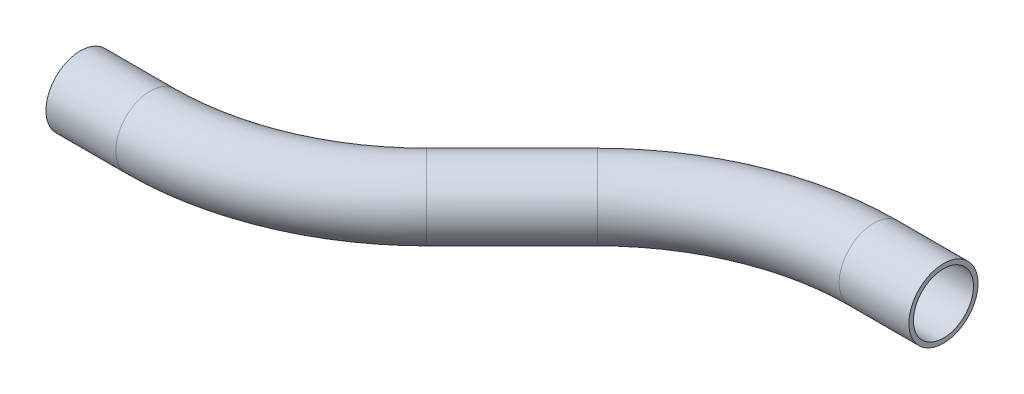
ISO-10303-21;
HEADER;
FILE_DESCRIPTION(('STEP AP214'),'2;1');
FILE_NAME('part.step','',(''),(''),'','','');
FILE_SCHEMA(('AUTOMOTIVE_DESIGN { 1 0 10303 214 1 1 1 1 }'));
ENDSEC;
DATA;
#1=APPLICATION_CONTEXT('core data for automotive mechanical design processes');
#2=APPLICATION_PROTOCOL_DEFINITION('international standard','automotive_design',2000,#1);
#3=PRODUCT_CONTEXT('',#1,'mechanical');
#4=PRODUCT('Part','Part','',(#3));
#5=PRODUCT_RELATED_PRODUCT_CATEGORY('part','',(#4));
#6=PRODUCT_DEFINITION_FORMATION('','',#4);
#7=PRODUCT_DEFINITION_CONTEXT('part definition',#1,'design');
#8=PRODUCT_DEFINITION('design','',#6,#7);
#9=PRODUCT_DEFINITION_SHAPE('','',#8);
#10=(LENGTH_UNIT() NAMED_UNIT(*) SI_UNIT(.MILLI.,.METRE.));
#11=(NAMED_UNIT(*) PLANE_ANGLE_UNIT() SI_UNIT($,.RADIAN.));
#12=(NAMED_UNIT(*) SI_UNIT($,.STERADIAN.) SOLID_ANGLE_UNIT());
#13=UNCERTAINTY_MEASURE_WITH_UNIT(LENGTH_MEASURE(1.E-05),#10,'distance_accuracy_value','');
#14=(GEOMETRIC_REPRESENTATION_CONTEXT(3) GLOBAL_UNCERTAINTY_ASSIGNED_CONTEXT((#13)) GLOBAL_UNIT_ASSIGNED_CONTEXT((#10,
#11,#12)) REPRESENTATION_CONTEXT('',''));
#15=CARTESIAN_POINT('',(0.,0.,0.));
#16=DIRECTION('',(0.,0.,1.));
#17=DIRECTION('',(1.,0.,0.));
#18=AXIS2_PLACEMENT_3D('',#15,#16,#17);
#19=CARTESIAN_POINT('',(0.,0.,0.));
#20=DIRECTION('',(1.,0.,0.));
#21=DIRECTION('',(0.,0.,-1.));
#22=AXIS2_PLACEMENT_3D('',#19,#20,#21);
#23=CYLINDRICAL_SURFACE('',#22,9.525);
#24=CARTESIAN_POINT('',(19.2369265471701,0.,0.));
#25=DIRECTION('',(1.,0.,0.));
#26=DIRECTION('',(0.,0.,-1.));
#27=AXIS2_PLACEMENT_3D('',#24,#25,#26);
#28=CIRCLE('',#27,9.525);
#29=CARTESIAN_POINT('',(19.2369265471701,0.,9.52499999999998));
#30=VERTEX_POINT('',#29);
#31=EDGE_CURVE('E59',#30,#30,#28,.T.);
#32=ORIENTED_EDGE('',*,*,#31,.F.);
#33=EDGE_LOOP('',(#32));
#34=FACE_BOUND('',#33,.T.);
#35=CARTESIAN_POINT('',(0.,0.,0.));
#36=DIRECTION('',(1.,0.,0.));
#37=DIRECTION('',(0.,0.,-1.));
#38=AXIS2_PLACEMENT_3D('',#35,#36,#37);
#39=CIRCLE('',#38,9.525);
#40=CARTESIAN_POINT('',(0.,0.,-9.525));
#41=VERTEX_POINT('',#40);
#42=EDGE_CURVE('E56',#41,#41,#39,.T.);
#43=ORIENTED_EDGE('',*,*,#42,.T.);
#44=EDGE_LOOP('',(#43));
#45=FACE_BOUND('',#44,.T.);
#46=ADVANCED_FACE('F35',(#34,#45),#23,.T.);
#47=CARTESIAN_POINT('',(19.2369265471701,0.,-76.2));
#48=DIRECTION('',(0.,1.,0.));
#49=DIRECTION('',(0.,0.,1.));
#50=AXIS2_PLACEMENT_3D('',#47,#48,#49);
#51=TOROIDAL_SURFACE('',#50,76.2,9.525);
#52=CARTESIAN_POINT('',(73.1184632735851,0.,-22.3184632735852));
#53=DIRECTION('',(0.707106781186546,0.,-0.707106781186549));
#54=DIRECTION('',(-0.707106781186549,0.,-0.707106781186546));
#55=AXIS2_PLACEMENT_3D('',#52,#53,#54);
#56=CIRCLE('',#55,9.525);
#57=CARTESIAN_POINT('',(79.853655364387,0.,-15.5832711827833));
#58=VERTEX_POINT('',#57);
#59=EDGE_CURVE('E62',#58,#58,#56,.T.);
#60=CARTESIAN_POINT('',(19.2369265471701,0.,-76.2));
#61=DIRECTION('',(0.,1.,0.));
#62=DIRECTION('',(0.,0.,1.));
#63=AXIS2_PLACEMENT_3D('',#60,#61,#62);
#64=CIRCLE('',#63,85.725);
#65=EDGE_CURVE('',#30,#58,#64,.T.);
#66=ORIENTED_EDGE('',*,*,#31,.T.);
#67=ORIENTED_EDGE('',*,*,#59,.F.);
#68=ORIENTED_EDGE('',*,*,#65,.T.);
#69=ORIENTED_EDGE('',*,*,#65,.F.);
#70=EDGE_LOOP('',(#66,#68,#67,#69));
#71=FACE_BOUND('',#70,.T.);
#72=ADVANCED_FACE('F81',(#71),#51,.T.);
#73=CARTESIAN_POINT('',(73.1184632735851,0.,-22.3184632735852));
#74=DIRECTION('',(0.707106781186547,0.,-0.707106781186548));
#75=DIRECTION('',(-0.707106781186548,0.,-0.707106781186547));
#76=AXIS2_PLACEMENT_3D('',#73,#74,#75);
#77=CYLINDRICAL_SURFACE('',#76,9.525);
#78=CARTESIAN_POINT('',(96.6376781380146,0.,-45.8376781380148));
#79=DIRECTION('',(0.707106781186547,0.,-0.707106781186548));
#80=DIRECTION('',(-0.707106781186548,0.,-0.707106781186547));
#81=AXIS2_PLACEMENT_3D('',#78,#79,#80);
#82=CIRCLE('',#81,9.525);
#83=CARTESIAN_POINT('',(89.9024860472127,0.,-52.5728702288167));
#84=VERTEX_POINT('',#83);
#85=EDGE_CURVE('E64',#84,#84,#82,.T.);
#86=ORIENTED_EDGE('',*,*,#85,.F.);
#87=EDGE_LOOP('',(#86));
#88=FACE_BOUND('',#87,.T.);
#89=ORIENTED_EDGE('',*,*,#59,.T.);
#90=EDGE_LOOP('',(#89));
#91=FACE_BOUND('',#90,.T.);
#92=ADVANCED_FACE('F74',(#88,#91),#77,.T.);
#93=CARTESIAN_POINT('',(150.51921486443,0.,8.04385858840001));
#94=DIRECTION('',(0.,-1.,0.));
#95=DIRECTION('',(0.,0.,-1.));
#96=AXIS2_PLACEMENT_3D('',#93,#94,#95);
#97=TOROIDAL_SURFACE('',#96,76.2,9.525);
#98=CARTESIAN_POINT('',(150.51921486443,0.,-68.1561414116));
#99=DIRECTION('',(1.,0.,0.));
#100=DIRECTION('',(0.,0.,-1.));
#101=AXIS2_PLACEMENT_3D('',#98,#99,#100);
#102=CIRCLE('',#101,9.525);
#103=CARTESIAN_POINT('',(150.51921486443,0.,-77.6811414116));
#104=VERTEX_POINT('',#103);
#105=EDGE_CURVE('E39',#104,#104,#102,.T.);
#106=CARTESIAN_POINT('',(150.51921486443,0.,8.04385858840001));
#107=DIRECTION('',(0.,-1.,0.));
#108=DIRECTION('',(0.,0.,-1.));
#109=AXIS2_PLACEMENT_3D('',#106,#107,#108);
#110=CIRCLE('',#109,85.725);
#111=EDGE_CURVE('',#84,#104,#110,.T.);
#112=ORIENTED_EDGE('',*,*,#85,.T.);
#113=ORIENTED_EDGE('',*,*,#105,.F.);
#114=ORIENTED_EDGE('',*,*,#111,.T.);
#115=ORIENTED_EDGE('',*,*,#111,.F.);
#116=EDGE_LOOP('',(#112,#114,#113,#115));
#117=FACE_BOUND('',#116,.T.);
#118=ADVANCED_FACE('F72',(#117),#97,.T.);
#119=CARTESIAN_POINT('',(150.51921486443,0.,-68.1561414116));
#120=DIRECTION('',(1.,0.,0.));
#121=DIRECTION('',(0.,0.,-1.));
#122=AXIS2_PLACEMENT_3D('',#119,#120,#121);
#123=CYLINDRICAL_SURFACE('',#122,9.525);
#124=CARTESIAN_POINT('',(169.7561414116,0.,-68.1561414116));
#125=DIRECTION('',(1.,0.,0.));
#126=DIRECTION('',(0.,0.,-1.));
#127=AXIS2_PLACEMENT_3D('',#124,#125,#126);
#128=CIRCLE('',#127,9.525);
#129=CARTESIAN_POINT('',(169.7561414116,0.,-77.6811414116));
#130=VERTEX_POINT('',#129);
#131=EDGE_CURVE('E52',#130,#130,#128,.T.);
#132=ORIENTED_EDGE('',*,*,#131,.F.);
#133=EDGE_LOOP('',(#132));
#134=FACE_BOUND('',#133,.T.);
#135=ORIENTED_EDGE('',*,*,#105,.T.);
#136=EDGE_LOOP('',(#135));
#137=FACE_BOUND('',#136,.T.);
#138=ADVANCED_FACE('F37',(#134,#137),#123,.T.);
#139=CARTESIAN_POINT('',(0.,0.,0.));
#140=DIRECTION('',(1.,0.,0.));
#141=DIRECTION('',(0.,0.,-1.));
#142=AXIS2_PLACEMENT_3D('',#139,#140,#141);
#143=PLANE('',#142);
#144=CARTESIAN_POINT('',(0.,0.,0.));
#145=DIRECTION('',(1.,0.,0.));
#146=DIRECTION('',(0.,0.,-1.));
#147=AXIS2_PLACEMENT_3D('',#144,#145,#146);
#148=CIRCLE('',#147,8.2804);
#149=CARTESIAN_POINT('',(0.,0.,-8.2804));
#150=VERTEX_POINT('',#149);
#151=EDGE_CURVE('E55',#150,#150,#148,.F.);
#152=ORIENTED_EDGE('',*,*,#151,.F.);
#153=EDGE_LOOP('',(#152));
#154=FACE_BOUND('',#153,.T.);
#155=ORIENTED_EDGE('',*,*,#42,.F.);
#156=EDGE_LOOP('',(#155));
#157=FACE_BOUND('',#156,.T.);
#158=ADVANCED_FACE('F79',(#154,#157),#143,.F.);
#159=CARTESIAN_POINT('',(169.7561414116,0.,-68.1561414116));
#160=DIRECTION('',(1.,0.,0.));
#161=DIRECTION('',(0.,0.,-1.));
#162=AXIS2_PLACEMENT_3D('',#159,#160,#161);
#163=PLANE('',#162);
#164=CARTESIAN_POINT('',(169.7561414116,0.,-68.1561414116));
#165=DIRECTION('',(1.,0.,0.));
#166=DIRECTION('',(0.,0.,-1.));
#167=AXIS2_PLACEMENT_3D('',#164,#165,#166);
#168=CIRCLE('',#167,8.2804);
#169=CARTESIAN_POINT('',(169.7561414116,0.,-76.4365414116));
#170=VERTEX_POINT('',#169);
#171=EDGE_CURVE('E10',#170,#170,#168,.F.);
#172=ORIENTED_EDGE('',*,*,#171,.T.);
#173=EDGE_LOOP('',(#172));
#174=FACE_BOUND('',#173,.T.);
#175=ORIENTED_EDGE('',*,*,#131,.T.);
#176=EDGE_LOOP('',(#175));
#177=FACE_BOUND('',#176,.T.);
#178=ADVANCED_FACE('F98',(#174,#177),#163,.T.);
#179=CARTESIAN_POINT('',(0.,0.,0.));
#180=DIRECTION('',(1.,0.,0.));
#181=DIRECTION('',(0.,0.,-1.));
#182=AXIS2_PLACEMENT_3D('',#179,#180,#181);
#183=CYLINDRICAL_SURFACE('',#182,8.2804);
#184=CARTESIAN_POINT('',(19.2369265471701,0.,0.));
#185=DIRECTION('',(1.,0.,0.));
#186=DIRECTION('',(0.,0.,-1.));
#187=AXIS2_PLACEMENT_3D('',#184,#185,#186);
#188=CIRCLE('',#187,8.2804);
#189=CARTESIAN_POINT('',(19.2369265471701,0.,8.28039999999996));
#190=VERTEX_POINT('',#189);
#191=EDGE_CURVE('E194',#190,#190,#188,.F.);
#192=ORIENTED_EDGE('',*,*,#191,.F.);
#193=EDGE_LOOP('',(#192));
#194=FACE_BOUND('',#193,.T.);
#195=ORIENTED_EDGE('',*,*,#151,.T.);
#196=EDGE_LOOP('',(#195));
#197=FACE_BOUND('',#196,.T.);
#198=ADVANCED_FACE('F101',(#194,#197),#183,.F.);
#199=CARTESIAN_POINT('',(19.2369265471701,0.,-76.2));
#200=DIRECTION('',(0.,1.,0.));
#201=DIRECTION('',(0.,0.,1.));
#202=AXIS2_PLACEMENT_3D('',#199,#200,#201);
#203=TOROIDAL_SURFACE('',#202,76.2,8.2804);
#204=CARTESIAN_POINT('',(73.1184632735851,0.,-22.3184632735852));
#205=DIRECTION('',(0.707106781186546,0.,-0.707106781186549));
#206=DIRECTION('',(-0.707106781186549,0.,-0.707106781186546));
#207=AXIS2_PLACEMENT_3D('',#204,#205,#206);
#208=CIRCLE('',#207,8.2804);
#209=CARTESIAN_POINT('',(78.9735902645222,0.,-16.4633362826481));
#210=VERTEX_POINT('',#209);
#211=EDGE_CURVE('E193',#210,#210,#208,.F.);
#212=CARTESIAN_POINT('',(19.2369265471701,0.,-76.2));
#213=DIRECTION('',(0.,1.,0.));
#214=DIRECTION('',(0.,0.,1.));
#215=AXIS2_PLACEMENT_3D('',#212,#213,#214);
#216=CIRCLE('',#215,84.4804);
#217=EDGE_CURVE('',#190,#210,#216,.T.);
#218=ORIENTED_EDGE('',*,*,#191,.T.);
#219=ORIENTED_EDGE('',*,*,#211,.F.);
#220=ORIENTED_EDGE('',*,*,#217,.T.);
#221=ORIENTED_EDGE('',*,*,#217,.F.);
#222=EDGE_LOOP('',(#218,#220,#219,#221));
#223=FACE_BOUND('',#222,.T.);
#224=ADVANCED_FACE('F156',(#223),#203,.F.);
#225=CARTESIAN_POINT('',(73.1184632735851,0.,-22.3184632735852));
#226=DIRECTION('',(0.707106781186547,0.,-0.707106781186548));
#227=DIRECTION('',(-0.707106781186548,0.,-0.707106781186547));
#228=AXIS2_PLACEMENT_3D('',#225,#226,#227);
#229=CYLINDRICAL_SURFACE('',#228,8.2804);
#230=CARTESIAN_POINT('',(96.6376781380146,0.,-45.8376781380148));
#231=DIRECTION('',(0.707106781186547,0.,-0.707106781186548));
#232=DIRECTION('',(-0.707106781186548,0.,-0.707106781186547));
#233=AXIS2_PLACEMENT_3D('',#230,#231,#232);
#234=CIRCLE('',#233,8.2804);
#235=CARTESIAN_POINT('',(90.7825511470775,0.,-51.6928051289519));
#236=VERTEX_POINT('',#235);
#237=EDGE_CURVE('E48',#236,#236,#234,.F.);
#238=ORIENTED_EDGE('',*,*,#237,.F.);
#239=EDGE_LOOP('',(#238));
#240=FACE_BOUND('',#239,.T.);
#241=ORIENTED_EDGE('',*,*,#211,.T.);
#242=EDGE_LOOP('',(#241));
#243=FACE_BOUND('',#242,.T.);
#244=ADVANCED_FACE('F92',(#240,#243),#229,.F.);
#245=CARTESIAN_POINT('',(150.51921486443,0.,8.04385858840001));
#246=DIRECTION('',(0.,-1.,0.));
#247=DIRECTION('',(0.,0.,-1.));
#248=AXIS2_PLACEMENT_3D('',#245,#246,#247);
#249=TOROIDAL_SURFACE('',#248,76.2,8.2804);
#250=CARTESIAN_POINT('',(150.51921486443,0.,-68.1561414116));
#251=DIRECTION('',(1.,0.,0.));
#252=DIRECTION('',(0.,0.,-1.));
#253=AXIS2_PLACEMENT_3D('',#250,#251,#252);
#254=CIRCLE('',#253,8.2804);
#255=CARTESIAN_POINT('',(150.51921486443,0.,-76.4365414116));
#256=VERTEX_POINT('',#255);
#257=EDGE_CURVE('E43',#256,#256,#254,.F.);
#258=CARTESIAN_POINT('',(150.51921486443,0.,8.04385858840001));
#259=DIRECTION('',(0.,-1.,0.));
#260=DIRECTION('',(0.,0.,-1.));
#261=AXIS2_PLACEMENT_3D('',#258,#259,#260);
#262=CIRCLE('',#261,84.4804);
#263=EDGE_CURVE('',#236,#256,#262,.T.);
#264=ORIENTED_EDGE('',*,*,#237,.T.);
#265=ORIENTED_EDGE('',*,*,#257,.F.);
#266=ORIENTED_EDGE('',*,*,#263,.T.);
#267=ORIENTED_EDGE('',*,*,#263,.F.);
#268=EDGE_LOOP('',(#264,#266,#265,#267));
#269=FACE_BOUND('',#268,.T.);
#270=ADVANCED_FACE('F86',(#269),#249,.F.);
#271=CARTESIAN_POINT('',(150.51921486443,0.,-68.1561414116));
#272=DIRECTION('',(1.,0.,0.));
#273=DIRECTION('',(0.,0.,-1.));
#274=AXIS2_PLACEMENT_3D('',#271,#272,#273);
#275=CYLINDRICAL_SURFACE('',#274,8.2804);
#276=ORIENTED_EDGE('',*,*,#171,.F.);
#277=EDGE_LOOP('',(#276));
#278=FACE_BOUND('',#277,.T.);
#279=ORIENTED_EDGE('',*,*,#257,.T.);
#280=EDGE_LOOP('',(#279));
#281=FACE_BOUND('',#280,.T.);
#282=ADVANCED_FACE('F84',(#278,#281),#275,.F.);
#283=CLOSED_SHELL('',(#46,#72,#92,#118,#138,#158,#178,#198,#224,#244,#270,#282));
#284=MANIFOLD_SOLID_BREP('B2',#283);
#285=ADVANCED_BREP_SHAPE_REPRESENTATION('',(#18,#284),#14);
#286=SHAPE_DEFINITION_REPRESENTATION(#9,#285);
ENDSEC;
END-ISO-10303-21;
